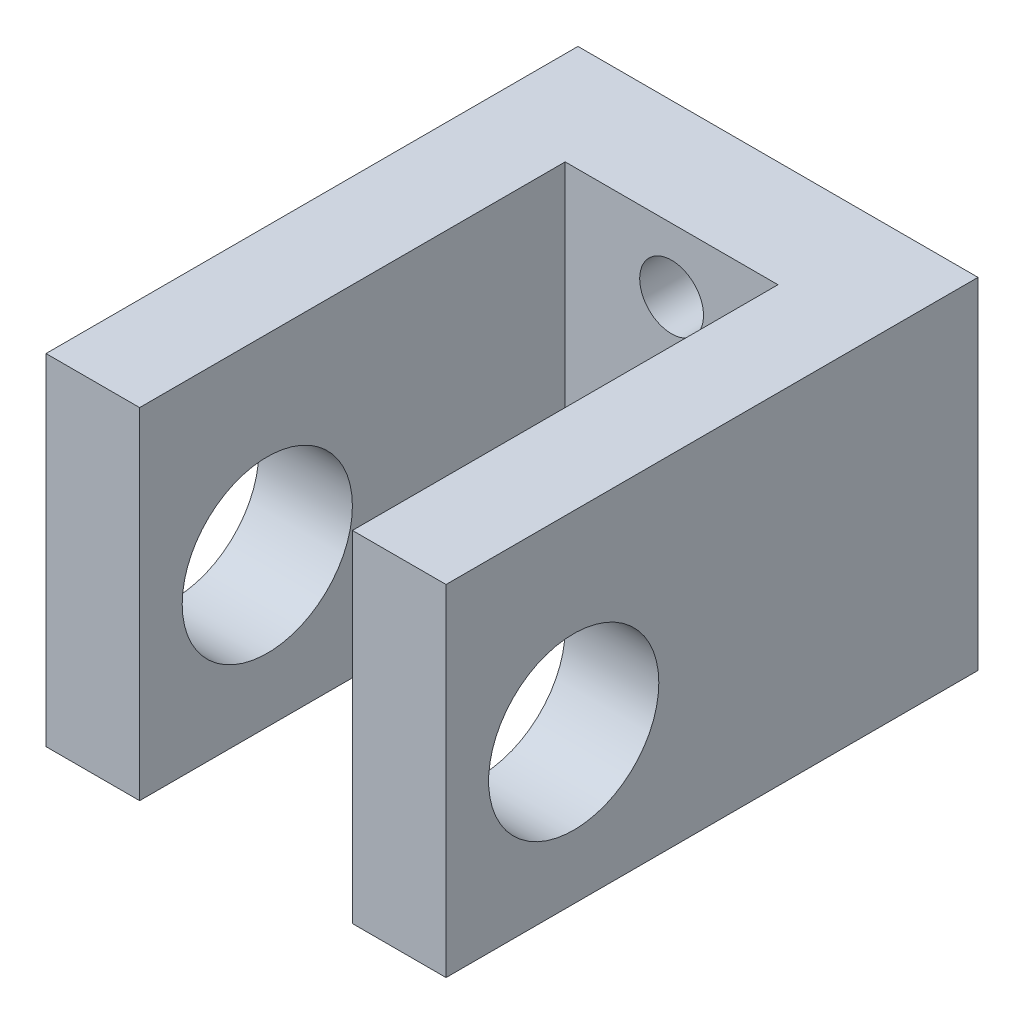
ISO-10303-21;
HEADER;
FILE_DESCRIPTION(('STEP AP214'),'2;1');
FILE_NAME('part.step','',(''),(''),'','','');
FILE_SCHEMA(('AUTOMOTIVE_DESIGN { 1 0 10303 214 1 1 1 1 }'));
ENDSEC;
DATA;
#1=APPLICATION_CONTEXT('core data for automotive mechanical design processes');
#2=APPLICATION_PROTOCOL_DEFINITION('international standard','automotive_design',2000,#1);
#3=PRODUCT_CONTEXT('',#1,'mechanical');
#4=PRODUCT('Part','Part','',(#3));
#5=PRODUCT_RELATED_PRODUCT_CATEGORY('part','',(#4));
#6=PRODUCT_DEFINITION_FORMATION('','',#4);
#7=PRODUCT_DEFINITION_CONTEXT('part definition',#1,'design');
#8=PRODUCT_DEFINITION('design','',#6,#7);
#9=PRODUCT_DEFINITION_SHAPE('','',#8);
#10=(LENGTH_UNIT() NAMED_UNIT(*) SI_UNIT(.MILLI.,.METRE.));
#11=(NAMED_UNIT(*) PLANE_ANGLE_UNIT() SI_UNIT($,.RADIAN.));
#12=(NAMED_UNIT(*) SI_UNIT($,.STERADIAN.) SOLID_ANGLE_UNIT());
#13=UNCERTAINTY_MEASURE_WITH_UNIT(LENGTH_MEASURE(1.E-05),#10,'distance_accuracy_value','');
#14=(GEOMETRIC_REPRESENTATION_CONTEXT(3) GLOBAL_UNCERTAINTY_ASSIGNED_CONTEXT((#13)) GLOBAL_UNIT_ASSIGNED_CONTEXT((#10,
#11,#12)) REPRESENTATION_CONTEXT('',''));
#15=CARTESIAN_POINT('',(0.,0.,0.));
#16=DIRECTION('',(0.,0.,1.));
#17=DIRECTION('',(1.,0.,0.));
#18=AXIS2_PLACEMENT_3D('',#15,#16,#17);
#19=CARTESIAN_POINT('',(9.4,16.,0.));
#20=DIRECTION('',(-1.,0.,0.));
#21=DIRECTION('',(0.,0.,1.));
#22=AXIS2_PLACEMENT_3D('',#19,#20,#21);
#23=PLANE('',#22);
#24=CARTESIAN_POINT('',(9.4,7.,19.));
#25=DIRECTION('',(1.,0.,0.));
#26=DIRECTION('',(0.,0.,-1.));
#27=AXIS2_PLACEMENT_3D('',#24,#25,#26);
#28=CIRCLE('',#27,4.);
#29=CARTESIAN_POINT('',(9.4,7.,15.));
#30=VERTEX_POINT('',#29);
#31=EDGE_CURVE('E163',#30,#30,#28,.T.);
#32=ORIENTED_EDGE('',*,*,#31,.F.);
#33=EDGE_LOOP('',(#32));
#34=FACE_BOUND('',#33,.T.);
#35=DIRECTION('',(0.,0.,-1.));
#36=VECTOR('',#35,1.);
#37=CARTESIAN_POINT('',(9.4,0.,0.));
#38=LINE('',#37,#36);
#39=CARTESIAN_POINT('',(9.4,0.,25.));
#40=VERTEX_POINT('',#39);
#41=CARTESIAN_POINT('',(9.4,0.,0.));
#42=VERTEX_POINT('',#41);
#43=EDGE_CURVE('E131',#40,#42,#38,.T.);
#44=ORIENTED_EDGE('',*,*,#43,.T.);
#45=DIRECTION('',(0.,-1.,0.));
#46=VECTOR('',#45,1.);
#47=CARTESIAN_POINT('',(9.4,16.,0.));
#48=LINE('',#47,#46);
#49=CARTESIAN_POINT('',(9.4,16.,0.));
#50=VERTEX_POINT('',#49);
#51=EDGE_CURVE('E11',#50,#42,#48,.T.);
#52=ORIENTED_EDGE('',*,*,#51,.F.);
#53=DIRECTION('',(0.,0.,-1.));
#54=VECTOR('',#53,1.);
#55=CARTESIAN_POINT('',(9.4,16.,0.));
#56=LINE('',#55,#54);
#57=CARTESIAN_POINT('',(9.4,16.,25.));
#58=VERTEX_POINT('',#57);
#59=EDGE_CURVE('E146',#58,#50,#56,.T.);
#60=ORIENTED_EDGE('',*,*,#59,.F.);
#61=DIRECTION('',(0.,-1.,0.));
#62=VECTOR('',#61,1.);
#63=CARTESIAN_POINT('',(9.4,16.,25.));
#64=LINE('',#63,#62);
#65=EDGE_CURVE('E127',#58,#40,#64,.T.);
#66=ORIENTED_EDGE('',*,*,#65,.T.);
#67=EDGE_LOOP('',(#44,#52,#60,#66));
#68=FACE_BOUND('',#67,.T.);
#69=ADVANCED_FACE('F33',(#34,#68),#23,.F.);
#70=CARTESIAN_POINT('',(-9.4,16.,0.));
#71=DIRECTION('',(0.,0.,1.));
#72=DIRECTION('',(1.,0.,0.));
#73=AXIS2_PLACEMENT_3D('',#70,#71,#72);
#74=PLANE('',#73);
#75=CARTESIAN_POINT('',(0.,3.,0.));
#76=DIRECTION('',(0.,0.,-1.));
#77=DIRECTION('',(1.,0.,0.));
#78=AXIS2_PLACEMENT_3D('',#75,#76,#77);
#79=CIRCLE('',#78,1.5);
#80=CARTESIAN_POINT('',(1.5,3.,0.));
#81=VERTEX_POINT('',#80);
#82=EDGE_CURVE('E174',#81,#81,#79,.T.);
#83=ORIENTED_EDGE('',*,*,#82,.F.);
#84=EDGE_LOOP('',(#83));
#85=FACE_BOUND('',#84,.T.);
#86=CARTESIAN_POINT('',(0.,13.,0.));
#87=DIRECTION('',(0.,0.,-1.));
#88=DIRECTION('',(-1.,0.,0.));
#89=AXIS2_PLACEMENT_3D('',#86,#87,#88);
#90=CIRCLE('',#89,1.5);
#91=CARTESIAN_POINT('',(-1.5,13.,0.));
#92=VERTEX_POINT('',#91);
#93=EDGE_CURVE('E164',#92,#92,#90,.T.);
#94=ORIENTED_EDGE('',*,*,#93,.F.);
#95=EDGE_LOOP('',(#94));
#96=FACE_BOUND('',#95,.T.);
#97=DIRECTION('',(-1.,0.,0.));
#98=VECTOR('',#97,1.);
#99=CARTESIAN_POINT('',(-9.4,0.,0.));
#100=LINE('',#99,#98);
#101=CARTESIAN_POINT('',(-9.4,0.,0.));
#102=VERTEX_POINT('',#101);
#103=EDGE_CURVE('E134',#42,#102,#100,.T.);
#104=ORIENTED_EDGE('',*,*,#103,.T.);
#105=DIRECTION('',(0.,-1.,0.));
#106=VECTOR('',#105,1.);
#107=CARTESIAN_POINT('',(-9.4,16.,0.));
#108=LINE('',#107,#106);
#109=CARTESIAN_POINT('',(-9.4,16.,0.));
#110=VERTEX_POINT('',#109);
#111=EDGE_CURVE('E42',#110,#102,#108,.T.);
#112=ORIENTED_EDGE('',*,*,#111,.F.);
#113=DIRECTION('',(-1.,0.,0.));
#114=VECTOR('',#113,1.);
#115=CARTESIAN_POINT('',(-9.4,16.,0.));
#116=LINE('',#115,#114);
#117=EDGE_CURVE('E94',#50,#110,#116,.T.);
#118=ORIENTED_EDGE('',*,*,#117,.F.);
#119=ORIENTED_EDGE('',*,*,#51,.T.);
#120=EDGE_LOOP('',(#104,#112,#118,#119));
#121=FACE_BOUND('',#120,.T.);
#122=ADVANCED_FACE('F215',(#85,#96,#121),#74,.F.);
#123=CARTESIAN_POINT('',(-9.4,16.,0.));
#124=DIRECTION('',(1.,0.,0.));
#125=DIRECTION('',(0.,0.,-1.));
#126=AXIS2_PLACEMENT_3D('',#123,#124,#125);
#127=PLANE('',#126);
#128=CARTESIAN_POINT('',(-9.4,7.,19.));
#129=DIRECTION('',(1.,0.,0.));
#130=DIRECTION('',(0.,0.,-1.));
#131=AXIS2_PLACEMENT_3D('',#128,#129,#130);
#132=CIRCLE('',#131,4.);
#133=CARTESIAN_POINT('',(-9.4,7.,15.));
#134=VERTEX_POINT('',#133);
#135=EDGE_CURVE('E160',#134,#134,#132,.T.);
#136=ORIENTED_EDGE('',*,*,#135,.T.);
#137=EDGE_LOOP('',(#136));
#138=FACE_BOUND('',#137,.T.);
#139=DIRECTION('',(0.,0.,1.));
#140=VECTOR('',#139,1.);
#141=CARTESIAN_POINT('',(-9.4,0.,0.));
#142=LINE('',#141,#140);
#143=CARTESIAN_POINT('',(-9.4,0.,25.));
#144=VERTEX_POINT('',#143);
#145=EDGE_CURVE('E137',#102,#144,#142,.T.);
#146=ORIENTED_EDGE('',*,*,#145,.T.);
#147=DIRECTION('',(0.,-1.,0.));
#148=VECTOR('',#147,1.);
#149=CARTESIAN_POINT('',(-9.4,16.,25.));
#150=LINE('',#149,#148);
#151=CARTESIAN_POINT('',(-9.4,16.,25.));
#152=VERTEX_POINT('',#151);
#153=EDGE_CURVE('E153',#152,#144,#150,.T.);
#154=ORIENTED_EDGE('',*,*,#153,.F.);
#155=DIRECTION('',(0.,0.,1.));
#156=VECTOR('',#155,1.);
#157=CARTESIAN_POINT('',(-9.4,16.,0.));
#158=LINE('',#157,#156);
#159=EDGE_CURVE('E183',#110,#152,#158,.T.);
#160=ORIENTED_EDGE('',*,*,#159,.F.);
#161=ORIENTED_EDGE('',*,*,#111,.T.);
#162=EDGE_LOOP('',(#146,#154,#160,#161));
#163=FACE_BOUND('',#162,.T.);
#164=ADVANCED_FACE('F220',(#138,#163),#127,.F.);
#165=CARTESIAN_POINT('',(-9.4,16.,25.));
#166=DIRECTION('',(0.,0.,-1.));
#167=DIRECTION('',(-1.,0.,0.));
#168=AXIS2_PLACEMENT_3D('',#165,#166,#167);
#169=PLANE('',#168);
#170=DIRECTION('',(1.,0.,0.));
#171=VECTOR('',#170,1.);
#172=CARTESIAN_POINT('',(-9.4,0.,25.));
#173=LINE('',#172,#171);
#174=CARTESIAN_POINT('',(-5.,0.,25.));
#175=VERTEX_POINT('',#174);
#176=EDGE_CURVE('E139',#144,#175,#173,.T.);
#177=ORIENTED_EDGE('',*,*,#176,.T.);
#178=DIRECTION('',(0.,-1.,0.));
#179=VECTOR('',#178,1.);
#180=CARTESIAN_POINT('',(-5.,16.,25.));
#181=LINE('',#180,#179);
#182=CARTESIAN_POINT('',(-5.,16.,25.));
#183=VERTEX_POINT('',#182);
#184=EDGE_CURVE('E150',#183,#175,#181,.T.);
#185=ORIENTED_EDGE('',*,*,#184,.F.);
#186=DIRECTION('',(1.,0.,0.));
#187=VECTOR('',#186,1.);
#188=CARTESIAN_POINT('',(-9.4,16.,25.));
#189=LINE('',#188,#187);
#190=EDGE_CURVE('E185',#152,#183,#189,.T.);
#191=ORIENTED_EDGE('',*,*,#190,.F.);
#192=ORIENTED_EDGE('',*,*,#153,.T.);
#193=EDGE_LOOP('',(#177,#185,#191,#192));
#194=FACE_BOUND('',#193,.T.);
#195=ADVANCED_FACE('F191',(#194),#169,.F.);
#196=CARTESIAN_POINT('',(-5.,16.,25.));
#197=DIRECTION('',(-1.,0.,0.));
#198=DIRECTION('',(0.,0.,1.));
#199=AXIS2_PLACEMENT_3D('',#196,#197,#198);
#200=PLANE('',#199);
#201=CARTESIAN_POINT('',(-5.,7.,19.));
#202=DIRECTION('',(-1.,0.,0.));
#203=DIRECTION('',(0.,0.,1.));
#204=AXIS2_PLACEMENT_3D('',#201,#202,#203);
#205=CIRCLE('',#204,4.);
#206=CARTESIAN_POINT('',(-5.,7.,23.));
#207=VERTEX_POINT('',#206);
#208=EDGE_CURVE('E135',#207,#207,#205,.T.);
#209=ORIENTED_EDGE('',*,*,#208,.T.);
#210=EDGE_LOOP('',(#209));
#211=FACE_BOUND('',#210,.T.);
#212=DIRECTION('',(0.,0.,-1.));
#213=VECTOR('',#212,1.);
#214=CARTESIAN_POINT('',(-5.,0.,25.));
#215=LINE('',#214,#213);
#216=CARTESIAN_POINT('',(-5.,0.,5.));
#217=VERTEX_POINT('',#216);
#218=EDGE_CURVE('E141',#175,#217,#215,.T.);
#219=ORIENTED_EDGE('',*,*,#218,.T.);
#220=DIRECTION('',(0.,-1.,0.));
#221=VECTOR('',#220,1.);
#222=CARTESIAN_POINT('',(-5.,16.,5.));
#223=LINE('',#222,#221);
#224=CARTESIAN_POINT('',(-5.,16.,5.));
#225=VERTEX_POINT('',#224);
#226=EDGE_CURVE('E122',#225,#217,#223,.T.);
#227=ORIENTED_EDGE('',*,*,#226,.F.);
#228=DIRECTION('',(0.,0.,-1.));
#229=VECTOR('',#228,1.);
#230=CARTESIAN_POINT('',(-5.,16.,25.));
#231=LINE('',#230,#229);
#232=EDGE_CURVE('E113',#183,#225,#231,.T.);
#233=ORIENTED_EDGE('',*,*,#232,.F.);
#234=ORIENTED_EDGE('',*,*,#184,.T.);
#235=EDGE_LOOP('',(#219,#227,#233,#234));
#236=FACE_BOUND('',#235,.T.);
#237=ADVANCED_FACE('F195',(#211,#236),#200,.F.);
#238=CARTESIAN_POINT('',(5.,16.,5.));
#239=DIRECTION('',(0.,0.,-1.));
#240=DIRECTION('',(-1.,0.,0.));
#241=AXIS2_PLACEMENT_3D('',#238,#239,#240);
#242=PLANE('',#241);
#243=CARTESIAN_POINT('',(0.,3.,5.));
#244=DIRECTION('',(0.,0.,-1.));
#245=DIRECTION('',(-1.,0.,0.));
#246=AXIS2_PLACEMENT_3D('',#243,#244,#245);
#247=CIRCLE('',#246,1.5);
#248=CARTESIAN_POINT('',(-1.5,3.,5.));
#249=VERTEX_POINT('',#248);
#250=EDGE_CURVE('E36',#249,#249,#247,.T.);
#251=ORIENTED_EDGE('',*,*,#250,.T.);
#252=EDGE_LOOP('',(#251));
#253=FACE_BOUND('',#252,.T.);
#254=CARTESIAN_POINT('',(0.,13.,5.));
#255=DIRECTION('',(0.,0.,-1.));
#256=DIRECTION('',(-1.,0.,0.));
#257=AXIS2_PLACEMENT_3D('',#254,#255,#256);
#258=CIRCLE('',#257,1.5);
#259=CARTESIAN_POINT('',(-1.5,13.,5.));
#260=VERTEX_POINT('',#259);
#261=EDGE_CURVE('E161',#260,#260,#258,.T.);
#262=ORIENTED_EDGE('',*,*,#261,.T.);
#263=EDGE_LOOP('',(#262));
#264=FACE_BOUND('',#263,.T.);
#265=DIRECTION('',(1.,0.,0.));
#266=VECTOR('',#265,1.);
#267=CARTESIAN_POINT('',(5.,0.,5.));
#268=LINE('',#267,#266);
#269=CARTESIAN_POINT('',(5.,0.,5.));
#270=VERTEX_POINT('',#269);
#271=EDGE_CURVE('E121',#217,#270,#268,.T.);
#272=ORIENTED_EDGE('',*,*,#271,.T.);
#273=DIRECTION('',(0.,-1.,0.));
#274=VECTOR('',#273,1.);
#275=CARTESIAN_POINT('',(5.,16.,5.));
#276=LINE('',#275,#274);
#277=CARTESIAN_POINT('',(5.,16.,5.));
#278=VERTEX_POINT('',#277);
#279=EDGE_CURVE('E118',#278,#270,#276,.T.);
#280=ORIENTED_EDGE('',*,*,#279,.F.);
#281=DIRECTION('',(1.,0.,0.));
#282=VECTOR('',#281,1.);
#283=CARTESIAN_POINT('',(5.,16.,5.));
#284=LINE('',#283,#282);
#285=EDGE_CURVE('E107',#225,#278,#284,.T.);
#286=ORIENTED_EDGE('',*,*,#285,.F.);
#287=ORIENTED_EDGE('',*,*,#226,.T.);
#288=EDGE_LOOP('',(#272,#280,#286,#287));
#289=FACE_BOUND('',#288,.T.);
#290=ADVANCED_FACE('F119',(#253,#264,#289),#242,.F.);
#291=CARTESIAN_POINT('',(5.,16.,25.));
#292=DIRECTION('',(1.,0.,0.));
#293=DIRECTION('',(0.,0.,-1.));
#294=AXIS2_PLACEMENT_3D('',#291,#292,#293);
#295=PLANE('',#294);
#296=CARTESIAN_POINT('',(5.,7.,19.));
#297=DIRECTION('',(1.,0.,0.));
#298=DIRECTION('',(0.,0.,-1.));
#299=AXIS2_PLACEMENT_3D('',#296,#297,#298);
#300=CIRCLE('',#299,4.);
#301=CARTESIAN_POINT('',(5.,7.,15.));
#302=VERTEX_POINT('',#301);
#303=EDGE_CURVE('E158',#302,#302,#300,.T.);
#304=ORIENTED_EDGE('',*,*,#303,.T.);
#305=EDGE_LOOP('',(#304));
#306=FACE_BOUND('',#305,.T.);
#307=DIRECTION('',(0.,0.,1.));
#308=VECTOR('',#307,1.);
#309=CARTESIAN_POINT('',(5.,0.,25.));
#310=LINE('',#309,#308);
#311=CARTESIAN_POINT('',(5.,0.,25.));
#312=VERTEX_POINT('',#311);
#313=EDGE_CURVE('E80',#270,#312,#310,.T.);
#314=ORIENTED_EDGE('',*,*,#313,.T.);
#315=DIRECTION('',(0.,-1.,0.));
#316=VECTOR('',#315,1.);
#317=CARTESIAN_POINT('',(5.,16.,25.));
#318=LINE('',#317,#316);
#319=CARTESIAN_POINT('',(5.,16.,25.));
#320=VERTEX_POINT('',#319);
#321=EDGE_CURVE('E123',#320,#312,#318,.T.);
#322=ORIENTED_EDGE('',*,*,#321,.F.);
#323=DIRECTION('',(0.,0.,1.));
#324=VECTOR('',#323,1.);
#325=CARTESIAN_POINT('',(5.,16.,25.));
#326=LINE('',#325,#324);
#327=EDGE_CURVE('E111',#278,#320,#326,.T.);
#328=ORIENTED_EDGE('',*,*,#327,.F.);
#329=ORIENTED_EDGE('',*,*,#279,.T.);
#330=EDGE_LOOP('',(#314,#322,#328,#329));
#331=FACE_BOUND('',#330,.T.);
#332=ADVANCED_FACE('F125',(#306,#331),#295,.F.);
#333=CARTESIAN_POINT('',(9.4,16.,25.));
#334=DIRECTION('',(0.,0.,-1.));
#335=DIRECTION('',(-1.,0.,0.));
#336=AXIS2_PLACEMENT_3D('',#333,#334,#335);
#337=PLANE('',#336);
#338=DIRECTION('',(1.,0.,0.));
#339=VECTOR('',#338,1.);
#340=CARTESIAN_POINT('',(9.4,0.,25.));
#341=LINE('',#340,#339);
#342=EDGE_CURVE('E86',#312,#40,#341,.T.);
#343=ORIENTED_EDGE('',*,*,#342,.T.);
#344=ORIENTED_EDGE('',*,*,#65,.F.);
#345=DIRECTION('',(1.,0.,0.));
#346=VECTOR('',#345,1.);
#347=CARTESIAN_POINT('',(9.4,16.,25.));
#348=LINE('',#347,#346);
#349=EDGE_CURVE('E51',#320,#58,#348,.T.);
#350=ORIENTED_EDGE('',*,*,#349,.F.);
#351=ORIENTED_EDGE('',*,*,#321,.T.);
#352=EDGE_LOOP('',(#343,#344,#350,#351));
#353=FACE_BOUND('',#352,.T.);
#354=ADVANCED_FACE('F203',(#353),#337,.F.);
#355=CARTESIAN_POINT('',(0.,16.,0.));
#356=DIRECTION('',(0.,-1.,0.));
#357=DIRECTION('',(0.,0.,-1.));
#358=AXIS2_PLACEMENT_3D('',#355,#356,#357);
#359=PLANE('',#358);
#360=ORIENTED_EDGE('',*,*,#59,.T.);
#361=ORIENTED_EDGE('',*,*,#117,.T.);
#362=ORIENTED_EDGE('',*,*,#159,.T.);
#363=ORIENTED_EDGE('',*,*,#190,.T.);
#364=ORIENTED_EDGE('',*,*,#232,.T.);
#365=ORIENTED_EDGE('',*,*,#285,.T.);
#366=ORIENTED_EDGE('',*,*,#327,.T.);
#367=ORIENTED_EDGE('',*,*,#349,.T.);
#368=EDGE_LOOP('',(#360,#361,#362,#363,#364,#365,#366,#367));
#369=FACE_BOUND('',#368,.T.);
#370=ADVANCED_FACE('F109',(#369),#359,.F.);
#371=CARTESIAN_POINT('',(0.,0.,0.));
#372=DIRECTION('',(0.,-1.,0.));
#373=DIRECTION('',(0.,0.,-1.));
#374=AXIS2_PLACEMENT_3D('',#371,#372,#373);
#375=PLANE('',#374);
#376=ORIENTED_EDGE('',*,*,#43,.F.);
#377=ORIENTED_EDGE('',*,*,#342,.F.);
#378=ORIENTED_EDGE('',*,*,#313,.F.);
#379=ORIENTED_EDGE('',*,*,#271,.F.);
#380=ORIENTED_EDGE('',*,*,#218,.F.);
#381=ORIENTED_EDGE('',*,*,#176,.F.);
#382=ORIENTED_EDGE('',*,*,#145,.F.);
#383=ORIENTED_EDGE('',*,*,#103,.F.);
#384=EDGE_LOOP('',(#376,#377,#378,#379,#380,#381,#382,#383));
#385=FACE_BOUND('',#384,.T.);
#386=ADVANCED_FACE('F198',(#385),#375,.T.);
#387=CARTESIAN_POINT('',(-9.4,7.,19.));
#388=DIRECTION('',(1.,0.,0.));
#389=DIRECTION('',(0.,0.,-1.));
#390=AXIS2_PLACEMENT_3D('',#387,#388,#389);
#391=CYLINDRICAL_SURFACE('',#390,4.);
#392=ORIENTED_EDGE('',*,*,#31,.T.);
#393=EDGE_LOOP('',(#392));
#394=FACE_BOUND('',#393,.T.);
#395=ORIENTED_EDGE('',*,*,#303,.F.);
#396=EDGE_LOOP('',(#395));
#397=FACE_BOUND('',#396,.T.);
#398=ADVANCED_FACE('F224',(#394,#397),#391,.F.);
#399=ORIENTED_EDGE('',*,*,#135,.F.);
#400=EDGE_LOOP('',(#399));
#401=FACE_BOUND('',#400,.T.);
#402=ORIENTED_EDGE('',*,*,#208,.F.);
#403=EDGE_LOOP('',(#402));
#404=FACE_BOUND('',#403,.T.);
#405=ADVANCED_FACE('F227',(#401,#404),#391,.F.);
#406=CARTESIAN_POINT('',(0.,13.,25.));
#407=DIRECTION('',(0.,0.,-1.));
#408=DIRECTION('',(-1.,0.,0.));
#409=AXIS2_PLACEMENT_3D('',#406,#407,#408);
#410=CYLINDRICAL_SURFACE('',#409,1.5);
#411=ORIENTED_EDGE('',*,*,#93,.T.);
#412=EDGE_LOOP('',(#411));
#413=FACE_BOUND('',#412,.T.);
#414=ORIENTED_EDGE('',*,*,#261,.F.);
#415=EDGE_LOOP('',(#414));
#416=FACE_BOUND('',#415,.T.);
#417=ADVANCED_FACE('F234',(#413,#416),#410,.F.);
#418=CARTESIAN_POINT('',(0.,3.,25.));
#419=DIRECTION('',(0.,0.,-1.));
#420=DIRECTION('',(-1.,0.,0.));
#421=AXIS2_PLACEMENT_3D('',#418,#419,#420);
#422=CYLINDRICAL_SURFACE('',#421,1.5);
#423=ORIENTED_EDGE('',*,*,#82,.T.);
#424=EDGE_LOOP('',(#423));
#425=FACE_BOUND('',#424,.T.);
#426=ORIENTED_EDGE('',*,*,#250,.F.);
#427=EDGE_LOOP('',(#426));
#428=FACE_BOUND('',#427,.T.);
#429=ADVANCED_FACE('F239',(#425,#428),#422,.F.);
#430=CLOSED_SHELL('',(#69,#122,#164,#195,#237,#290,#332,#354,#370,#386,#398,#405,#417,#429));
#431=MANIFOLD_SOLID_BREP('B2',#430);
#432=ADVANCED_BREP_SHAPE_REPRESENTATION('',(#18,#431),#14);
#433=SHAPE_DEFINITION_REPRESENTATION(#9,#432);
ENDSEC;
END-ISO-10303-21;
